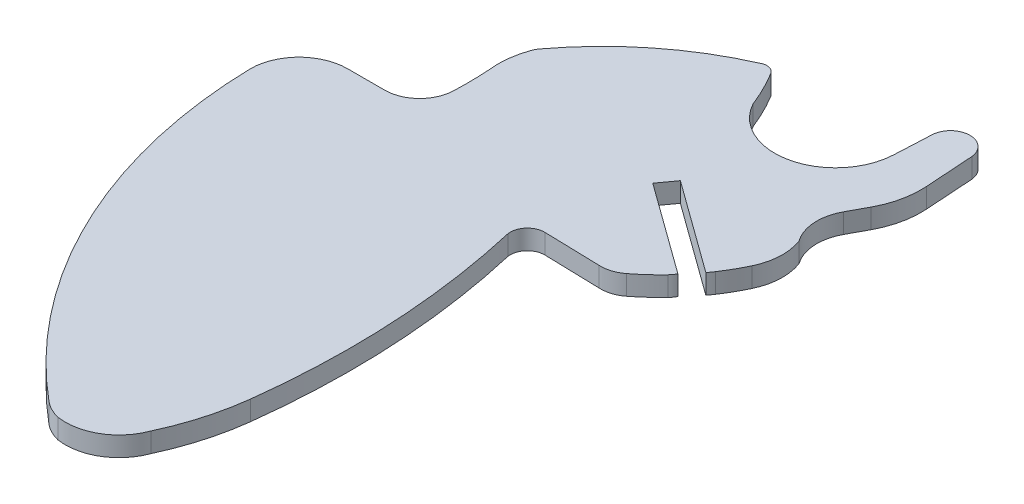
ISO-10303-21;
HEADER;
FILE_DESCRIPTION(('STEP AP214'),'2;1');
FILE_NAME('part.step','',(''),(''),'','','');
FILE_SCHEMA(('AUTOMOTIVE_DESIGN { 1 0 10303 214 1 1 1 1 }'));
ENDSEC;
DATA;
#1=APPLICATION_CONTEXT('core data for automotive mechanical design processes');
#2=APPLICATION_PROTOCOL_DEFINITION('international standard','automotive_design',2000,#1);
#3=PRODUCT_CONTEXT('',#1,'mechanical');
#4=PRODUCT('Part','Part','',(#3));
#5=PRODUCT_RELATED_PRODUCT_CATEGORY('part','',(#4));
#6=PRODUCT_DEFINITION_FORMATION('','',#4);
#7=PRODUCT_DEFINITION_CONTEXT('part definition',#1,'design');
#8=PRODUCT_DEFINITION('design','',#6,#7);
#9=PRODUCT_DEFINITION_SHAPE('','',#8);
#10=(LENGTH_UNIT() NAMED_UNIT(*) SI_UNIT(.MILLI.,.METRE.));
#11=(NAMED_UNIT(*) PLANE_ANGLE_UNIT() SI_UNIT($,.RADIAN.));
#12=(NAMED_UNIT(*) SI_UNIT($,.STERADIAN.) SOLID_ANGLE_UNIT());
#13=UNCERTAINTY_MEASURE_WITH_UNIT(LENGTH_MEASURE(1.E-05),#10,'distance_accuracy_value','');
#14=(GEOMETRIC_REPRESENTATION_CONTEXT(3) GLOBAL_UNCERTAINTY_ASSIGNED_CONTEXT((#13)) GLOBAL_UNIT_ASSIGNED_CONTEXT((#10,
#11,#12)) REPRESENTATION_CONTEXT('',''));
#15=CARTESIAN_POINT('',(0.,0.,0.));
#16=DIRECTION('',(0.,0.,1.));
#17=DIRECTION('',(1.,0.,0.));
#18=AXIS2_PLACEMENT_3D('',#15,#16,#17);
#19=CARTESIAN_POINT('',(239.342860407213,1.45,-286.03723770318));
#20=DIRECTION('',(0.997796574415949,0.,-0.0663475401488044));
#21=DIRECTION('',(-0.0663475401488044,0.,-0.997796574415949));
#22=AXIS2_PLACEMENT_3D('',#19,#20,#21);
#23=PLANE('',#22);
#24=DIRECTION('',(0.0663475401488045,0.,0.997796574415949));
#25=VECTOR('',#24,1.);
#26=CARTESIAN_POINT('',(239.342860407213,0.,-286.03723770318));
#27=LINE('',#26,#25);
#28=CARTESIAN_POINT('',(238.653022555033,0.,-296.411666721409));
#29=VERTEX_POINT('',#28);
#30=CARTESIAN_POINT('',(238.893011470654,0.,-292.802488184158));
#31=VERTEX_POINT('',#30);
#32=EDGE_CURVE('E275',#29,#31,#27,.T.);
#33=ORIENTED_EDGE('',*,*,#32,.F.);
#34=DIRECTION('',(0.,-1.,0.));
#35=VECTOR('',#34,1.);
#36=CARTESIAN_POINT('',(238.653022555033,1.45,-296.411666721409));
#37=LINE('',#36,#35);
#38=CARTESIAN_POINT('',(238.653022555033,1.45,-296.411666721409));
#39=VERTEX_POINT('',#38);
#40=EDGE_CURVE('E11',#39,#29,#37,.T.);
#41=ORIENTED_EDGE('',*,*,#40,.F.);
#42=DIRECTION('',(0.0663475401488045,0.,0.997796574415949));
#43=VECTOR('',#42,1.);
#44=CARTESIAN_POINT('',(239.342860407213,1.45,-286.03723770318));
#45=LINE('',#44,#43);
#46=CARTESIAN_POINT('',(238.893011470654,1.45,-292.802488184158));
#47=VERTEX_POINT('',#46);
#48=EDGE_CURVE('E350',#39,#47,#45,.T.);
#49=ORIENTED_EDGE('',*,*,#48,.T.);
#50=DIRECTION('',(0.,-1.,0.));
#51=VECTOR('',#50,1.);
#52=CARTESIAN_POINT('',(238.893011470654,1.45,-292.802488184158));
#53=LINE('',#52,#51);
#54=EDGE_CURVE('E159',#47,#31,#53,.T.);
#55=ORIENTED_EDGE('',*,*,#54,.T.);
#56=EDGE_LOOP('',(#33,#41,#49,#55));
#57=FACE_BOUND('',#56,.T.);
#58=ADVANCED_FACE('F37',(#57),#23,.T.);
#59=CARTESIAN_POINT('',(237.22674988179,1.45,-296.250436404309));
#60=DIRECTION('',(0.,-1.,0.));
#61=DIRECTION('',(0.,0.,-1.));
#62=AXIS2_PLACEMENT_3D('',#59,#60,#61);
#63=CYLINDRICAL_SURFACE('',#62,1.43535673391348);
#64=CARTESIAN_POINT('',(237.22674988179,0.,-296.250436404309));
#65=DIRECTION('',(0.,1.,0.));
#66=DIRECTION('',(0.,0.,1.));
#67=AXIS2_PLACEMENT_3D('',#64,#65,#66);
#68=CIRCLE('',#67,1.43535673391348);
#69=CARTESIAN_POINT('',(235.793360273238,0.,-296.325557531073));
#70=VERTEX_POINT('',#69);
#71=EDGE_CURVE('E278',#29,#70,#68,.T.);
#72=ORIENTED_EDGE('',*,*,#71,.T.);
#73=DIRECTION('',(0.,-1.,0.));
#74=VECTOR('',#73,1.);
#75=CARTESIAN_POINT('',(235.793360273238,1.45,-296.325557531073));
#76=LINE('',#75,#74);
#77=CARTESIAN_POINT('',(235.793360273238,1.45,-296.325557531073));
#78=VERTEX_POINT('',#77);
#79=EDGE_CURVE('E45',#78,#70,#76,.T.);
#80=ORIENTED_EDGE('',*,*,#79,.F.);
#81=CARTESIAN_POINT('',(237.22674988179,1.45,-296.250436404309));
#82=DIRECTION('',(0.,1.,0.));
#83=DIRECTION('',(0.,0.,1.));
#84=AXIS2_PLACEMENT_3D('',#81,#82,#83);
#85=CIRCLE('',#84,1.43535673391348);
#86=EDGE_CURVE('E442',#39,#78,#85,.T.);
#87=ORIENTED_EDGE('',*,*,#86,.F.);
#88=ORIENTED_EDGE('',*,*,#40,.T.);
#89=EDGE_LOOP('',(#72,#80,#87,#88));
#90=FACE_BOUND('',#89,.T.);
#91=ADVANCED_FACE('F430',(#90),#63,.T.);
#92=CARTESIAN_POINT('',(-108.378688046165,1.45,-311.623136456129));
#93=DIRECTION('',(0.,-1.,0.));
#94=DIRECTION('',(0.,0.,-1.));
#95=AXIS2_PLACEMENT_3D('',#92,#93,#94);
#96=CYLINDRICAL_SURFACE('',#95,344.5118499636);
#97=CARTESIAN_POINT('',(-108.378688046165,0.,-311.623136456129));
#98=DIRECTION('',(0.,1.,0.));
#99=DIRECTION('',(0.,0.,1.));
#100=AXIS2_PLACEMENT_3D('',#97,#98,#99);
#101=CIRCLE('',#100,344.5118499636);
#102=CARTESIAN_POINT('',(235.66102085318,0.,-293.592787990403));
#103=VERTEX_POINT('',#102);
#104=EDGE_CURVE('E281',#103,#70,#101,.T.);
#105=ORIENTED_EDGE('',*,*,#104,.F.);
#106=DIRECTION('',(0.,-1.,0.));
#107=VECTOR('',#106,1.);
#108=CARTESIAN_POINT('',(235.66102085318,1.45,-293.592787990403));
#109=LINE('',#108,#107);
#110=CARTESIAN_POINT('',(235.66102085318,1.45,-293.592787990403));
#111=VERTEX_POINT('',#110);
#112=EDGE_CURVE('E420',#111,#103,#109,.T.);
#113=ORIENTED_EDGE('',*,*,#112,.F.);
#114=CARTESIAN_POINT('',(-108.378688046165,1.45,-311.623136456129));
#115=DIRECTION('',(0.,1.,0.));
#116=DIRECTION('',(0.,0.,1.));
#117=AXIS2_PLACEMENT_3D('',#114,#115,#116);
#118=CIRCLE('',#117,344.5118499636);
#119=EDGE_CURVE('E427',#111,#78,#118,.T.);
#120=ORIENTED_EDGE('',*,*,#119,.T.);
#121=ORIENTED_EDGE('',*,*,#79,.T.);
#122=EDGE_LOOP('',(#105,#113,#120,#121));
#123=FACE_BOUND('',#122,.T.);
#124=ADVANCED_FACE('F425',(#123),#96,.F.);
#125=CARTESIAN_POINT('',(231.174853341948,1.45,-293.827898067158));
#126=DIRECTION('',(0.,-1.,0.));
#127=DIRECTION('',(0.,0.,-1.));
#128=AXIS2_PLACEMENT_3D('',#125,#126,#127);
#129=CYLINDRICAL_SURFACE('',#128,4.49232408526289);
#130=CARTESIAN_POINT('',(231.174853341948,0.,-293.827898067158));
#131=DIRECTION('',(0.,1.,0.));
#132=DIRECTION('',(0.,0.,1.));
#133=AXIS2_PLACEMENT_3D('',#130,#131,#132);
#134=CIRCLE('',#133,4.49232408526289);
#135=CARTESIAN_POINT('',(227.226828646089,0.,-291.684518332271));
#136=VERTEX_POINT('',#135);
#137=EDGE_CURVE('E284',#136,#103,#134,.T.);
#138=ORIENTED_EDGE('',*,*,#137,.F.);
#139=DIRECTION('',(0.,-1.,0.));
#140=VECTOR('',#139,1.);
#141=CARTESIAN_POINT('',(227.226828646089,1.45,-291.684518332271));
#142=LINE('',#141,#140);
#143=CARTESIAN_POINT('',(227.226828646089,1.45,-291.684518332271));
#144=VERTEX_POINT('',#143);
#145=EDGE_CURVE('E418',#144,#136,#142,.T.);
#146=ORIENTED_EDGE('',*,*,#145,.F.);
#147=CARTESIAN_POINT('',(231.174853341948,1.45,-293.827898067158));
#148=DIRECTION('',(0.,1.,0.));
#149=DIRECTION('',(0.,0.,1.));
#150=AXIS2_PLACEMENT_3D('',#147,#148,#149);
#151=CIRCLE('',#150,4.49232408526289);
#152=EDGE_CURVE('E441',#144,#111,#151,.T.);
#153=ORIENTED_EDGE('',*,*,#152,.T.);
#154=ORIENTED_EDGE('',*,*,#112,.T.);
#155=EDGE_LOOP('',(#138,#146,#153,#154));
#156=FACE_BOUND('',#155,.T.);
#157=ADVANCED_FACE('F437',(#156),#129,.F.);
#158=CARTESIAN_POINT('',(211.453490184729,1.45,-285.48871265457));
#159=DIRECTION('',(0.,-1.,0.));
#160=DIRECTION('',(0.,0.,-1.));
#161=AXIS2_PLACEMENT_3D('',#158,#159,#160);
#162=CYLINDRICAL_SURFACE('',#161,16.94656939361);
#163=CARTESIAN_POINT('',(211.453490184729,0.,-285.48871265457));
#164=DIRECTION('',(0.,1.,0.));
#165=DIRECTION('',(0.,0.,1.));
#166=AXIS2_PLACEMENT_3D('',#163,#164,#165);
#167=CIRCLE('',#166,16.94656939361);
#168=CARTESIAN_POINT('',(225.911305804312,0.,-294.32940163918));
#169=VERTEX_POINT('',#168);
#170=EDGE_CURVE('E287',#136,#169,#167,.T.);
#171=ORIENTED_EDGE('',*,*,#170,.T.);
#172=DIRECTION('',(0.,-1.,0.));
#173=VECTOR('',#172,1.);
#174=CARTESIAN_POINT('',(225.911305804312,1.45,-294.32940163918));
#175=LINE('',#174,#173);
#176=CARTESIAN_POINT('',(225.911305804312,1.45,-294.32940163918));
#177=VERTEX_POINT('',#176);
#178=EDGE_CURVE('E415',#177,#169,#175,.T.);
#179=ORIENTED_EDGE('',*,*,#178,.F.);
#180=CARTESIAN_POINT('',(211.453490184729,1.45,-285.48871265457));
#181=DIRECTION('',(0.,1.,0.));
#182=DIRECTION('',(0.,0.,1.));
#183=AXIS2_PLACEMENT_3D('',#180,#181,#182);
#184=CIRCLE('',#183,16.94656939361);
#185=EDGE_CURVE('E444',#144,#177,#184,.T.);
#186=ORIENTED_EDGE('',*,*,#185,.F.);
#187=ORIENTED_EDGE('',*,*,#145,.T.);
#188=EDGE_LOOP('',(#171,#179,#186,#187));
#189=FACE_BOUND('',#188,.T.);
#190=ADVANCED_FACE('F522',(#189),#162,.T.);
#191=CARTESIAN_POINT('',(225.281208839804,1.45,-293.869228525155));
#192=DIRECTION('',(0.,-1.,0.));
#193=DIRECTION('',(0.,0.,-1.));
#194=AXIS2_PLACEMENT_3D('',#191,#192,#193);
#195=CYLINDRICAL_SURFACE('',#194,0.780244499854758);
#196=CARTESIAN_POINT('',(225.281208839804,0.,-293.869228525155));
#197=DIRECTION('',(0.,1.,0.));
#198=DIRECTION('',(0.,0.,1.));
#199=AXIS2_PLACEMENT_3D('',#196,#197,#198);
#200=CIRCLE('',#199,0.780244499854758);
#201=CARTESIAN_POINT('',(224.908611284519,0.,-294.554759371543));
#202=VERTEX_POINT('',#201);
#203=EDGE_CURVE('E289',#169,#202,#200,.T.);
#204=ORIENTED_EDGE('',*,*,#203,.T.);
#205=DIRECTION('',(0.,-1.,0.));
#206=VECTOR('',#205,1.);
#207=CARTESIAN_POINT('',(224.908611284519,1.45,-294.554759371543));
#208=LINE('',#207,#206);
#209=CARTESIAN_POINT('',(224.908611284519,1.45,-294.554759371543));
#210=VERTEX_POINT('',#209);
#211=EDGE_CURVE('E412',#210,#202,#208,.T.);
#212=ORIENTED_EDGE('',*,*,#211,.F.);
#213=CARTESIAN_POINT('',(225.281208839804,1.45,-293.869228525155));
#214=DIRECTION('',(0.,1.,0.));
#215=DIRECTION('',(0.,0.,1.));
#216=AXIS2_PLACEMENT_3D('',#213,#214,#215);
#217=CIRCLE('',#216,0.780244499854758);
#218=EDGE_CURVE('E450',#177,#210,#217,.T.);
#219=ORIENTED_EDGE('',*,*,#218,.F.);
#220=ORIENTED_EDGE('',*,*,#178,.T.);
#221=EDGE_LOOP('',(#204,#212,#219,#220));
#222=FACE_BOUND('',#221,.T.);
#223=ADVANCED_FACE('F525',(#222),#195,.T.);
#224=CARTESIAN_POINT('',(234.125168481019,1.45,-273.692954713846));
#225=DIRECTION('',(0.,-1.,0.));
#226=DIRECTION('',(0.,0.,-1.));
#227=AXIS2_PLACEMENT_3D('',#224,#225,#226);
#228=CYLINDRICAL_SURFACE('',#227,22.807012520983);
#229=CARTESIAN_POINT('',(234.125168481019,0.,-273.692954713846));
#230=DIRECTION('',(0.,1.,0.));
#231=DIRECTION('',(0.,0.,1.));
#232=AXIS2_PLACEMENT_3D('',#229,#230,#231);
#233=CIRCLE('',#232,22.807012520983);
#234=CARTESIAN_POINT('',(215.845643343035,0.,-287.331824933262));
#235=VERTEX_POINT('',#234);
#236=EDGE_CURVE('E291',#202,#235,#233,.T.);
#237=ORIENTED_EDGE('',*,*,#236,.T.);
#238=DIRECTION('',(0.,-1.,0.));
#239=VECTOR('',#238,1.);
#240=CARTESIAN_POINT('',(215.845643343035,1.45,-287.331824933262));
#241=LINE('',#240,#239);
#242=CARTESIAN_POINT('',(215.845643343035,1.45,-287.331824933262));
#243=VERTEX_POINT('',#242);
#244=EDGE_CURVE('E409',#243,#235,#241,.T.);
#245=ORIENTED_EDGE('',*,*,#244,.F.);
#246=CARTESIAN_POINT('',(234.125168481019,1.45,-273.692954713846));
#247=DIRECTION('',(0.,1.,0.));
#248=DIRECTION('',(0.,0.,1.));
#249=AXIS2_PLACEMENT_3D('',#246,#247,#248);
#250=CIRCLE('',#249,22.807012520983);
#251=EDGE_CURVE('E452',#210,#243,#250,.T.);
#252=ORIENTED_EDGE('',*,*,#251,.F.);
#253=ORIENTED_EDGE('',*,*,#211,.T.);
#254=EDGE_LOOP('',(#237,#245,#252,#253));
#255=FACE_BOUND('',#254,.T.);
#256=ADVANCED_FACE('F529',(#255),#228,.T.);
#257=CARTESIAN_POINT('',(217.143035900167,1.45,-286.363804073982));
#258=DIRECTION('',(0.,-1.,0.));
#259=DIRECTION('',(0.,0.,-1.));
#260=AXIS2_PLACEMENT_3D('',#257,#258,#259);
#261=CYLINDRICAL_SURFACE('',#260,1.61873155010442);
#262=CARTESIAN_POINT('',(217.143035900167,0.,-286.363804073982));
#263=DIRECTION('',(0.,1.,0.));
#264=DIRECTION('',(0.,0.,1.));
#265=AXIS2_PLACEMENT_3D('',#262,#263,#264);
#266=CIRCLE('',#265,1.61873155010442);
#267=CARTESIAN_POINT('',(215.642710770853,0.,-286.971518100192));
#268=VERTEX_POINT('',#267);
#269=EDGE_CURVE('E293',#235,#268,#266,.T.);
#270=ORIENTED_EDGE('',*,*,#269,.T.);
#271=DIRECTION('',(0.,-1.,0.));
#272=VECTOR('',#271,1.);
#273=CARTESIAN_POINT('',(215.642710770853,1.45,-286.971518100192));
#274=LINE('',#273,#272);
#275=CARTESIAN_POINT('',(215.642710770853,1.45,-286.971518100192));
#276=VERTEX_POINT('',#275);
#277=EDGE_CURVE('E406',#276,#268,#274,.T.);
#278=ORIENTED_EDGE('',*,*,#277,.F.);
#279=CARTESIAN_POINT('',(217.143035900167,1.45,-286.363804073982));
#280=DIRECTION('',(0.,1.,0.));
#281=DIRECTION('',(0.,0.,1.));
#282=AXIS2_PLACEMENT_3D('',#279,#280,#281);
#283=CIRCLE('',#282,1.61873155010442);
#284=EDGE_CURVE('E454',#243,#276,#283,.T.);
#285=ORIENTED_EDGE('',*,*,#284,.F.);
#286=ORIENTED_EDGE('',*,*,#244,.T.);
#287=EDGE_LOOP('',(#270,#278,#285,#286));
#288=FACE_BOUND('',#287,.T.);
#289=ADVANCED_FACE('F533',(#288),#261,.T.);
#290=CARTESIAN_POINT('',(221.393094772318,1.45,-284.845875835249));
#291=DIRECTION('',(0.,-1.,0.));
#292=DIRECTION('',(0.,0.,-1.));
#293=AXIS2_PLACEMENT_3D('',#290,#291,#292);
#294=CYLINDRICAL_SURFACE('',#293,6.13068276807879);
#295=CARTESIAN_POINT('',(221.393094772318,0.,-284.845875835249));
#296=DIRECTION('',(0.,1.,0.));
#297=DIRECTION('',(0.,0.,1.));
#298=AXIS2_PLACEMENT_3D('',#295,#296,#297);
#299=CIRCLE('',#298,6.13068276807879);
#300=CARTESIAN_POINT('',(215.312427533884,0.,-284.064366309868));
#301=VERTEX_POINT('',#300);
#302=EDGE_CURVE('E295',#268,#301,#299,.T.);
#303=ORIENTED_EDGE('',*,*,#302,.T.);
#304=DIRECTION('',(0.,-1.,0.));
#305=VECTOR('',#304,1.);
#306=CARTESIAN_POINT('',(215.312427533884,1.45,-284.064366309868));
#307=LINE('',#306,#305);
#308=CARTESIAN_POINT('',(215.312427533884,1.45,-284.064366309868));
#309=VERTEX_POINT('',#308);
#310=EDGE_CURVE('E404',#309,#301,#307,.T.);
#311=ORIENTED_EDGE('',*,*,#310,.F.);
#312=CARTESIAN_POINT('',(221.393094772318,1.45,-284.845875835249));
#313=DIRECTION('',(0.,1.,0.));
#314=DIRECTION('',(0.,0.,1.));
#315=AXIS2_PLACEMENT_3D('',#312,#313,#314);
#316=CIRCLE('',#315,6.13068276807879);
#317=EDGE_CURVE('E456',#276,#309,#316,.T.);
#318=ORIENTED_EDGE('',*,*,#317,.F.);
#319=ORIENTED_EDGE('',*,*,#277,.T.);
#320=EDGE_LOOP('',(#303,#311,#318,#319));
#321=FACE_BOUND('',#320,.T.);
#322=ADVANCED_FACE('F537',(#321),#294,.T.);
#323=CARTESIAN_POINT('',(190.902069896325,1.45,-282.490384144395));
#324=DIRECTION('',(0.,-1.,0.));
#325=DIRECTION('',(0.,0.,-1.));
#326=AXIS2_PLACEMENT_3D('',#323,#324,#325);
#327=CYLINDRICAL_SURFACE('',#326,24.4610502605835);
#328=CARTESIAN_POINT('',(190.902069896325,0.,-282.490384144395));
#329=DIRECTION('',(0.,1.,0.));
#330=DIRECTION('',(0.,0.,1.));
#331=AXIS2_PLACEMENT_3D('',#328,#329,#330);
#332=CIRCLE('',#331,24.4610502605835);
#333=CARTESIAN_POINT('',(215.341184768393,0.,-281.454698805769));
#334=VERTEX_POINT('',#333);
#335=EDGE_CURVE('E298',#334,#301,#332,.T.);
#336=ORIENTED_EDGE('',*,*,#335,.F.);
#337=DIRECTION('',(0.,-1.,0.));
#338=VECTOR('',#337,1.);
#339=CARTESIAN_POINT('',(215.341184768393,1.45,-281.454698805769));
#340=LINE('',#339,#338);
#341=CARTESIAN_POINT('',(215.341184768393,1.45,-281.454698805769));
#342=VERTEX_POINT('',#341);
#343=EDGE_CURVE('E402',#342,#334,#340,.T.);
#344=ORIENTED_EDGE('',*,*,#343,.F.);
#345=CARTESIAN_POINT('',(190.902069896325,1.45,-282.490384144395));
#346=DIRECTION('',(0.,1.,0.));
#347=DIRECTION('',(0.,0.,1.));
#348=AXIS2_PLACEMENT_3D('',#345,#346,#347);
#349=CIRCLE('',#348,24.4610502605835);
#350=EDGE_CURVE('E458',#342,#309,#349,.T.);
#351=ORIENTED_EDGE('',*,*,#350,.T.);
#352=ORIENTED_EDGE('',*,*,#310,.T.);
#353=EDGE_LOOP('',(#336,#344,#351,#352));
#354=FACE_BOUND('',#353,.T.);
#355=ADVANCED_FACE('F541',(#354),#327,.F.);
#356=CARTESIAN_POINT('',(212.76590353859,1.45,-281.563834497764));
#357=DIRECTION('',(0.,-1.,0.));
#358=DIRECTION('',(0.,0.,-1.));
#359=AXIS2_PLACEMENT_3D('',#356,#357,#358);
#360=CYLINDRICAL_SURFACE('',#359,2.57759267764408);
#361=CARTESIAN_POINT('',(212.76590353859,0.,-281.563834497764));
#362=DIRECTION('',(0.,1.,0.));
#363=DIRECTION('',(0.,0.,1.));
#364=AXIS2_PLACEMENT_3D('',#361,#362,#363);
#365=CIRCLE('',#364,2.57759267764408);
#366=CARTESIAN_POINT('',(212.76590353859,0.,-278.98624182012));
#367=VERTEX_POINT('',#366);
#368=EDGE_CURVE('E301',#367,#334,#365,.T.);
#369=ORIENTED_EDGE('',*,*,#368,.F.);
#370=DIRECTION('',(0.,-1.,0.));
#371=VECTOR('',#370,1.);
#372=CARTESIAN_POINT('',(212.76590353859,1.45,-278.98624182012));
#373=LINE('',#372,#371);
#374=CARTESIAN_POINT('',(212.76590353859,1.45,-278.98624182012));
#375=VERTEX_POINT('',#374);
#376=EDGE_CURVE('E400',#375,#367,#373,.T.);
#377=ORIENTED_EDGE('',*,*,#376,.F.);
#378=CARTESIAN_POINT('',(212.76590353859,1.45,-281.563834497764));
#379=DIRECTION('',(0.,1.,0.));
#380=DIRECTION('',(0.,0.,1.));
#381=AXIS2_PLACEMENT_3D('',#378,#379,#380);
#382=CIRCLE('',#381,2.57759267764408);
#383=EDGE_CURVE('E461',#375,#342,#382,.T.);
#384=ORIENTED_EDGE('',*,*,#383,.T.);
#385=ORIENTED_EDGE('',*,*,#343,.T.);
#386=EDGE_LOOP('',(#369,#377,#384,#385));
#387=FACE_BOUND('',#386,.T.);
#388=ADVANCED_FACE('F545',(#387),#360,.F.);
#389=CARTESIAN_POINT('',(-48.3605605496074,1.45,-278.986218569562));
#390=DIRECTION('',(-8.90394555433146E-08,0.,-0.999999999999996));
#391=DIRECTION('',(-0.999999999999996,0.,8.90394555433146E-08));
#392=AXIS2_PLACEMENT_3D('',#389,#390,#391);
#393=PLANE('',#392);
#394=DIRECTION('',(0.999999999999996,0.,-8.90394555433147E-08));
#395=VECTOR('',#394,1.);
#396=CARTESIAN_POINT('',(-48.3605605496074,0.,-278.986218569562));
#397=LINE('',#396,#395);
#398=CARTESIAN_POINT('',(210.03682424265,0.,-278.986241577124));
#399=VERTEX_POINT('',#398);
#400=EDGE_CURVE('E304',#399,#367,#397,.T.);
#401=ORIENTED_EDGE('',*,*,#400,.F.);
#402=DIRECTION('',(0.,-1.,0.));
#403=VECTOR('',#402,1.);
#404=CARTESIAN_POINT('',(210.03682424265,1.45,-278.986241577124));
#405=LINE('',#404,#403);
#406=CARTESIAN_POINT('',(210.03682424265,1.45,-278.986241577124));
#407=VERTEX_POINT('',#406);
#408=EDGE_CURVE('E398',#407,#399,#405,.T.);
#409=ORIENTED_EDGE('',*,*,#408,.F.);
#410=DIRECTION('',(0.999999999999996,0.,-8.90394555433147E-08));
#411=VECTOR('',#410,1.);
#412=CARTESIAN_POINT('',(-48.3605605496074,1.45,-278.986218569562));
#413=LINE('',#412,#411);
#414=EDGE_CURVE('E464',#407,#375,#413,.T.);
#415=ORIENTED_EDGE('',*,*,#414,.T.);
#416=ORIENTED_EDGE('',*,*,#376,.T.);
#417=EDGE_LOOP('',(#401,#409,#415,#416));
#418=FACE_BOUND('',#417,.T.);
#419=ADVANCED_FACE('F549',(#418),#393,.T.);
#420=CARTESIAN_POINT('',(210.03682424265,1.45,-275.39026169406));
#421=DIRECTION('',(0.,-1.,0.));
#422=DIRECTION('',(0.,0.,-1.));
#423=AXIS2_PLACEMENT_3D('',#420,#421,#422);
#424=CYLINDRICAL_SURFACE('',#423,3.59597988306427);
#425=CARTESIAN_POINT('',(210.03682424265,0.,-275.39026169406));
#426=DIRECTION('',(0.,1.,0.));
#427=DIRECTION('',(0.,0.,1.));
#428=AXIS2_PLACEMENT_3D('',#425,#426,#427);
#429=CIRCLE('',#428,3.59597988306427);
#430=CARTESIAN_POINT('',(206.440844359586,0.,-275.390261694059));
#431=VERTEX_POINT('',#430);
#432=EDGE_CURVE('E307',#399,#431,#429,.T.);
#433=ORIENTED_EDGE('',*,*,#432,.T.);
#434=DIRECTION('',(0.,-1.,0.));
#435=VECTOR('',#434,1.);
#436=CARTESIAN_POINT('',(206.440844359586,1.45,-275.390261694059));
#437=LINE('',#436,#435);
#438=CARTESIAN_POINT('',(206.440844359586,1.45,-275.390261694059));
#439=VERTEX_POINT('',#438);
#440=EDGE_CURVE('E395',#439,#431,#437,.T.);
#441=ORIENTED_EDGE('',*,*,#440,.F.);
#442=CARTESIAN_POINT('',(210.03682424265,1.45,-275.39026169406));
#443=DIRECTION('',(0.,1.,0.));
#444=DIRECTION('',(0.,0.,1.));
#445=AXIS2_PLACEMENT_3D('',#442,#443,#444);
#446=CIRCLE('',#445,3.59597988306427);
#447=EDGE_CURVE('E467',#407,#439,#446,.T.);
#448=ORIENTED_EDGE('',*,*,#447,.F.);
#449=ORIENTED_EDGE('',*,*,#408,.T.);
#450=EDGE_LOOP('',(#433,#441,#448,#449));
#451=FACE_BOUND('',#450,.T.);
#452=ADVANCED_FACE('F553',(#451),#424,.T.);
#453=CARTESIAN_POINT('',(244.925267792631,1.45,-276.279899589043));
#454=DIRECTION('',(0.,-1.,0.));
#455=DIRECTION('',(0.,0.,-1.));
#456=AXIS2_PLACEMENT_3D('',#453,#454,#455);
#457=CYLINDRICAL_SURFACE('',#456,38.494704863892);
#458=CARTESIAN_POINT('',(244.925267792631,0.,-276.279899589043));
#459=DIRECTION('',(0.,1.,0.));
#460=DIRECTION('',(0.,0.,1.));
#461=AXIS2_PLACEMENT_3D('',#458,#459,#460);
#462=CIRCLE('',#461,38.494704863892);
#463=CARTESIAN_POINT('',(220.27794118263,0.,-246.710462774351));
#464=VERTEX_POINT('',#463);
#465=EDGE_CURVE('E309',#431,#464,#462,.T.);
#466=ORIENTED_EDGE('',*,*,#465,.T.);
#467=DIRECTION('',(0.,-1.,0.));
#468=VECTOR('',#467,1.);
#469=CARTESIAN_POINT('',(220.27794118263,1.45,-246.710462774351));
#470=LINE('',#469,#468);
#471=CARTESIAN_POINT('',(220.27794118263,1.45,-246.710462774351));
#472=VERTEX_POINT('',#471);
#473=EDGE_CURVE('E392',#472,#464,#470,.T.);
#474=ORIENTED_EDGE('',*,*,#473,.F.);
#475=CARTESIAN_POINT('',(244.925267792631,1.45,-276.279899589043));
#476=DIRECTION('',(0.,1.,0.));
#477=DIRECTION('',(0.,0.,1.));
#478=AXIS2_PLACEMENT_3D('',#475,#476,#477);
#479=CIRCLE('',#478,38.494704863892);
#480=EDGE_CURVE('E469',#439,#472,#479,.T.);
#481=ORIENTED_EDGE('',*,*,#480,.F.);
#482=ORIENTED_EDGE('',*,*,#440,.T.);
#483=EDGE_LOOP('',(#466,#474,#481,#482));
#484=FACE_BOUND('',#483,.T.);
#485=ADVANCED_FACE('F557',(#484),#457,.T.);
#486=CARTESIAN_POINT('',(222.373935410536,1.45,-249.22500435528));
#487=DIRECTION('',(0.,-1.,0.));
#488=DIRECTION('',(0.,0.,-1.));
#489=AXIS2_PLACEMENT_3D('',#486,#487,#488);
#490=CYLINDRICAL_SURFACE('',#489,3.27354718396341);
#491=CARTESIAN_POINT('',(222.373935410536,0.,-249.22500435528));
#492=DIRECTION('',(0.,1.,0.));
#493=DIRECTION('',(0.,0.,1.));
#494=AXIS2_PLACEMENT_3D('',#491,#492,#493);
#495=CIRCLE('',#494,3.27354718396341);
#496=CARTESIAN_POINT('',(221.589592945179,0.,-246.046810204087));
#497=VERTEX_POINT('',#496);
#498=EDGE_CURVE('E311',#464,#497,#495,.T.);
#499=ORIENTED_EDGE('',*,*,#498,.T.);
#500=DIRECTION('',(0.,-1.,0.));
#501=VECTOR('',#500,1.);
#502=CARTESIAN_POINT('',(221.589592945179,1.45,-246.046810204087));
#503=LINE('',#502,#501);
#504=CARTESIAN_POINT('',(221.589592945179,1.45,-246.046810204087));
#505=VERTEX_POINT('',#504);
#506=EDGE_CURVE('E389',#505,#497,#503,.T.);
#507=ORIENTED_EDGE('',*,*,#506,.F.);
#508=CARTESIAN_POINT('',(222.373935410536,1.45,-249.22500435528));
#509=DIRECTION('',(0.,1.,0.));
#510=DIRECTION('',(0.,0.,1.));
#511=AXIS2_PLACEMENT_3D('',#508,#509,#510);
#512=CIRCLE('',#511,3.27354718396341);
#513=EDGE_CURVE('E471',#472,#505,#512,.T.);
#514=ORIENTED_EDGE('',*,*,#513,.F.);
#515=ORIENTED_EDGE('',*,*,#473,.T.);
#516=EDGE_LOOP('',(#499,#507,#514,#515));
#517=FACE_BOUND('',#516,.T.);
#518=ADVANCED_FACE('F561',(#517),#490,.T.);
#519=CARTESIAN_POINT('',(222.190871634359,1.45,-249.961498492968));
#520=DIRECTION('',(0.,-1.,0.));
#521=DIRECTION('',(0.,0.,-1.));
#522=AXIS2_PLACEMENT_3D('',#519,#520,#521);
#523=CYLINDRICAL_SURFACE('',#522,3.96059597297722);
#524=CARTESIAN_POINT('',(222.190871634359,0.,-249.961498492968));
#525=DIRECTION('',(0.,1.,0.));
#526=DIRECTION('',(0.,0.,1.));
#527=AXIS2_PLACEMENT_3D('',#524,#525,#526);
#528=CIRCLE('',#527,3.96059597297722);
#529=CARTESIAN_POINT('',(225.905960816543,0.,-248.588752038016));
#530=VERTEX_POINT('',#529);
#531=EDGE_CURVE('E313',#497,#530,#528,.T.);
#532=ORIENTED_EDGE('',*,*,#531,.T.);
#533=DIRECTION('',(0.,-1.,0.));
#534=VECTOR('',#533,1.);
#535=CARTESIAN_POINT('',(225.905960816543,1.45,-248.588752038016));
#536=LINE('',#535,#534);
#537=CARTESIAN_POINT('',(225.905960816543,1.45,-248.588752038016));
#538=VERTEX_POINT('',#537);
#539=EDGE_CURVE('E386',#538,#530,#536,.T.);
#540=ORIENTED_EDGE('',*,*,#539,.F.);
#541=CARTESIAN_POINT('',(222.190871634359,1.45,-249.961498492968));
#542=DIRECTION('',(0.,1.,0.));
#543=DIRECTION('',(0.,0.,1.));
#544=AXIS2_PLACEMENT_3D('',#541,#542,#543);
#545=CIRCLE('',#544,3.96059597297722);
#546=EDGE_CURVE('E473',#505,#538,#545,.T.);
#547=ORIENTED_EDGE('',*,*,#546,.F.);
#548=ORIENTED_EDGE('',*,*,#506,.T.);
#549=EDGE_LOOP('',(#532,#540,#547,#548));
#550=FACE_BOUND('',#549,.T.);
#551=ADVANCED_FACE('F565',(#550),#523,.T.);
#552=CARTESIAN_POINT('',(208.71358547496,1.45,-256.602388158567));
#553=DIRECTION('',(0.,-1.,0.));
#554=DIRECTION('',(0.,0.,-1.));
#555=AXIS2_PLACEMENT_3D('',#552,#553,#554);
#556=CYLINDRICAL_SURFACE('',#555,18.968292853034);
#557=CARTESIAN_POINT('',(208.71358547496,0.,-256.602388158567));
#558=DIRECTION('',(0.,1.,0.));
#559=DIRECTION('',(0.,0.,1.));
#560=AXIS2_PLACEMENT_3D('',#557,#558,#559);
#561=CIRCLE('',#560,18.968292853034);
#562=CARTESIAN_POINT('',(227.542844257863,0.,-254.309977321712));
#563=VERTEX_POINT('',#562);
#564=EDGE_CURVE('E315',#530,#563,#561,.T.);
#565=ORIENTED_EDGE('',*,*,#564,.T.);
#566=DIRECTION('',(0.,-1.,0.));
#567=VECTOR('',#566,1.);
#568=CARTESIAN_POINT('',(227.542844257863,1.45,-254.309977321712));
#569=LINE('',#568,#567);
#570=CARTESIAN_POINT('',(227.542844257863,1.45,-254.309977321712));
#571=VERTEX_POINT('',#570);
#572=EDGE_CURVE('E383',#571,#563,#569,.T.);
#573=ORIENTED_EDGE('',*,*,#572,.F.);
#574=CARTESIAN_POINT('',(208.71358547496,1.45,-256.602388158567));
#575=DIRECTION('',(0.,1.,0.));
#576=DIRECTION('',(0.,0.,1.));
#577=AXIS2_PLACEMENT_3D('',#574,#575,#576);
#578=CIRCLE('',#577,18.968292853034);
#579=EDGE_CURVE('E475',#538,#571,#578,.T.);
#580=ORIENTED_EDGE('',*,*,#579,.F.);
#581=ORIENTED_EDGE('',*,*,#539,.T.);
#582=EDGE_LOOP('',(#565,#573,#580,#581));
#583=FACE_BOUND('',#582,.T.);
#584=ADVANCED_FACE('F569',(#583),#556,.T.);
#585=CARTESIAN_POINT('',(170.111911583872,1.45,-261.302035503144));
#586=DIRECTION('',(0.,-1.,0.));
#587=DIRECTION('',(0.,0.,-1.));
#588=AXIS2_PLACEMENT_3D('',#585,#586,#587);
#589=CYLINDRICAL_SURFACE('',#588,57.854998966528);
#590=CARTESIAN_POINT('',(170.111911583872,0.,-261.302035503144));
#591=DIRECTION('',(0.,1.,0.));
#592=DIRECTION('',(0.,0.,1.));
#593=AXIS2_PLACEMENT_3D('',#590,#591,#592);
#594=CIRCLE('',#593,57.854998966528);
#595=CARTESIAN_POINT('',(226.470760006698,0.,-274.374185665604));
#596=VERTEX_POINT('',#595);
#597=EDGE_CURVE('E317',#563,#596,#594,.T.);
#598=ORIENTED_EDGE('',*,*,#597,.T.);
#599=DIRECTION('',(0.,-1.,0.));
#600=VECTOR('',#599,1.);
#601=CARTESIAN_POINT('',(226.470760006698,1.45,-274.374185665604));
#602=LINE('',#601,#600);
#603=CARTESIAN_POINT('',(226.470760006698,1.45,-274.374185665604));
#604=VERTEX_POINT('',#603);
#605=EDGE_CURVE('E381',#604,#596,#602,.T.);
#606=ORIENTED_EDGE('',*,*,#605,.F.);
#607=CARTESIAN_POINT('',(170.111911583872,1.45,-261.302035503144));
#608=DIRECTION('',(0.,1.,0.));
#609=DIRECTION('',(0.,0.,1.));
#610=AXIS2_PLACEMENT_3D('',#607,#608,#609);
#611=CIRCLE('',#610,57.854998966528);
#612=EDGE_CURVE('E477',#571,#604,#611,.T.);
#613=ORIENTED_EDGE('',*,*,#612,.F.);
#614=ORIENTED_EDGE('',*,*,#572,.T.);
#615=EDGE_LOOP('',(#598,#606,#613,#614));
#616=FACE_BOUND('',#615,.T.);
#617=ADVANCED_FACE('F573',(#616),#589,.T.);
#618=CARTESIAN_POINT('',(227.732274280214,1.45,-274.539833097751));
#619=DIRECTION('',(0.,-1.,0.));
#620=DIRECTION('',(0.,0.,-1.));
#621=AXIS2_PLACEMENT_3D('',#618,#619,#620);
#622=CYLINDRICAL_SURFACE('',#621,1.27234324537926);
#623=CARTESIAN_POINT('',(227.732274280214,0.,-274.539833097751));
#624=DIRECTION('',(0.,1.,0.));
#625=DIRECTION('',(0.,0.,1.));
#626=AXIS2_PLACEMENT_3D('',#623,#624,#625);
#627=CIRCLE('',#626,1.27234324537926);
#628=CARTESIAN_POINT('',(227.766545332812,0.,-275.811714707421));
#629=VERTEX_POINT('',#628);
#630=EDGE_CURVE('E320',#629,#596,#627,.T.);
#631=ORIENTED_EDGE('',*,*,#630,.F.);
#632=DIRECTION('',(0.,-1.,0.));
#633=VECTOR('',#632,1.);
#634=CARTESIAN_POINT('',(227.766545332812,1.45,-275.811714707421));
#635=LINE('',#634,#633);
#636=CARTESIAN_POINT('',(227.766545332812,1.45,-275.811714707421));
#637=VERTEX_POINT('',#636);
#638=EDGE_CURVE('E379',#637,#629,#635,.T.);
#639=ORIENTED_EDGE('',*,*,#638,.F.);
#640=CARTESIAN_POINT('',(227.732274280214,1.45,-274.539833097751));
#641=DIRECTION('',(0.,1.,0.));
#642=DIRECTION('',(0.,0.,1.));
#643=AXIS2_PLACEMENT_3D('',#640,#641,#642);
#644=CIRCLE('',#643,1.27234324537926);
#645=EDGE_CURVE('E479',#637,#604,#644,.T.);
#646=ORIENTED_EDGE('',*,*,#645,.T.);
#647=ORIENTED_EDGE('',*,*,#605,.T.);
#648=EDGE_LOOP('',(#631,#639,#646,#647));
#649=FACE_BOUND('',#648,.T.);
#650=ADVANCED_FACE('F577',(#649),#622,.F.);
#651=CARTESIAN_POINT('',(-47.9204518986769,1.45,-283.240139141716));
#652=DIRECTION('',(0.0269353625954859,0.,-0.999637177300769));
#653=DIRECTION('',(-0.999637177300769,0.,-0.0269353625954859));
#654=AXIS2_PLACEMENT_3D('',#651,#652,#653);
#655=PLANE('',#654);
#656=DIRECTION('',(0.999637177300769,0.,0.0269353625954859));
#657=VECTOR('',#656,1.);
#658=CARTESIAN_POINT('',(-47.9204518986769,0.,-283.240139141716));
#659=LINE('',#658,#657);
#660=CARTESIAN_POINT('',(231.852265795572,0.,-275.701624402031));
#661=VERTEX_POINT('',#660);
#662=EDGE_CURVE('E323',#629,#661,#659,.T.);
#663=ORIENTED_EDGE('',*,*,#662,.T.);
#664=DIRECTION('',(0.,-1.,0.));
#665=VECTOR('',#664,1.);
#666=CARTESIAN_POINT('',(231.852265795572,1.45,-275.701624402031));
#667=LINE('',#666,#665);
#668=CARTESIAN_POINT('',(231.852265795572,1.45,-275.701624402031));
#669=VERTEX_POINT('',#668);
#670=EDGE_CURVE('E376',#669,#661,#667,.T.);
#671=ORIENTED_EDGE('',*,*,#670,.F.);
#672=DIRECTION('',(0.999637177300769,0.,0.0269353625954859));
#673=VECTOR('',#672,1.);
#674=CARTESIAN_POINT('',(-47.9204518986769,1.45,-283.240139141716));
#675=LINE('',#674,#673);
#676=EDGE_CURVE('E482',#637,#669,#675,.T.);
#677=ORIENTED_EDGE('',*,*,#676,.F.);
#678=ORIENTED_EDGE('',*,*,#638,.T.);
#679=EDGE_LOOP('',(#663,#671,#677,#678));
#680=FACE_BOUND('',#679,.T.);
#681=ADVANCED_FACE('F581',(#680),#655,.F.);
#682=CARTESIAN_POINT('',(231.96883773448,1.45,-278.025255123394));
#683=DIRECTION('',(0.,-1.,0.));
#684=DIRECTION('',(0.,0.,-1.));
#685=AXIS2_PLACEMENT_3D('',#682,#683,#684);
#686=CYLINDRICAL_SURFACE('',#685,2.32655297515533);
#687=CARTESIAN_POINT('',(231.96883773448,0.,-278.025255123394));
#688=DIRECTION('',(0.,1.,0.));
#689=DIRECTION('',(0.,0.,1.));
#690=AXIS2_PLACEMENT_3D('',#687,#688,#689);
#691=CIRCLE('',#690,2.32655297515533);
#692=CARTESIAN_POINT('',(233.396048176315,0.,-276.187887685748));
#693=VERTEX_POINT('',#692);
#694=EDGE_CURVE('E325',#661,#693,#691,.T.);
#695=ORIENTED_EDGE('',*,*,#694,.T.);
#696=DIRECTION('',(0.,-1.,0.));
#697=VECTOR('',#696,1.);
#698=CARTESIAN_POINT('',(233.396048176315,1.45,-276.187887685748));
#699=LINE('',#698,#697);
#700=CARTESIAN_POINT('',(233.396048176315,1.45,-276.187887685748));
#701=VERTEX_POINT('',#700);
#702=EDGE_CURVE('E373',#701,#693,#699,.T.);
#703=ORIENTED_EDGE('',*,*,#702,.F.);
#704=CARTESIAN_POINT('',(231.96883773448,1.45,-278.025255123394));
#705=DIRECTION('',(0.,1.,0.));
#706=DIRECTION('',(0.,0.,1.));
#707=AXIS2_PLACEMENT_3D('',#704,#705,#706);
#708=CIRCLE('',#707,2.32655297515533);
#709=EDGE_CURVE('E484',#669,#701,#708,.T.);
#710=ORIENTED_EDGE('',*,*,#709,.F.);
#711=ORIENTED_EDGE('',*,*,#670,.T.);
#712=EDGE_LOOP('',(#695,#703,#710,#711));
#713=FACE_BOUND('',#712,.T.);
#714=ADVANCED_FACE('F585',(#713),#686,.T.);
#715=CARTESIAN_POINT('',(224.610817116699,1.45,-287.497850774416));
#716=DIRECTION('',(0.,-1.,0.));
#717=DIRECTION('',(0.,0.,-1.));
#718=AXIS2_PLACEMENT_3D('',#715,#716,#717);
#719=CYLINDRICAL_SURFACE('',#718,14.321157419632);
#720=CARTESIAN_POINT('',(224.610817116699,0.,-287.497850774416));
#721=DIRECTION('',(0.,1.,0.));
#722=DIRECTION('',(0.,0.,1.));
#723=AXIS2_PLACEMENT_3D('',#720,#721,#722);
#724=CIRCLE('',#723,14.321157419632);
#725=CARTESIAN_POINT('',(235.005599552553,0.,-277.646757030616));
#726=VERTEX_POINT('',#725);
#727=EDGE_CURVE('E327',#693,#726,#724,.T.);
#728=ORIENTED_EDGE('',*,*,#727,.T.);
#729=DIRECTION('',(0.,-1.,0.));
#730=VECTOR('',#729,1.);
#731=CARTESIAN_POINT('',(235.005599552553,1.45,-277.646757030616));
#732=LINE('',#731,#730);
#733=CARTESIAN_POINT('',(235.005599552553,1.45,-277.646757030616));
#734=VERTEX_POINT('',#733);
#735=EDGE_CURVE('E370',#734,#726,#732,.T.);
#736=ORIENTED_EDGE('',*,*,#735,.F.);
#737=CARTESIAN_POINT('',(224.610817116699,1.45,-287.497850774416));
#738=DIRECTION('',(0.,1.,0.));
#739=DIRECTION('',(0.,0.,1.));
#740=AXIS2_PLACEMENT_3D('',#737,#738,#739);
#741=CIRCLE('',#740,14.321157419632);
#742=EDGE_CURVE('E486',#701,#734,#741,.T.);
#743=ORIENTED_EDGE('',*,*,#742,.F.);
#744=ORIENTED_EDGE('',*,*,#702,.T.);
#745=EDGE_LOOP('',(#728,#736,#743,#744));
#746=FACE_BOUND('',#745,.T.);
#747=ADVANCED_FACE('F589',(#746),#719,.T.);
#748=CARTESIAN_POINT('',(233.583705069533,1.45,-278.994281000803));
#749=DIRECTION('',(0.,-1.,0.));
#750=DIRECTION('',(0.,0.,-1.));
#751=AXIS2_PLACEMENT_3D('',#748,#749,#750);
#752=CYLINDRICAL_SURFACE('',#751,1.95898054382129);
#753=CARTESIAN_POINT('',(233.583705069533,0.,-278.994281000803));
#754=DIRECTION('',(0.,1.,0.));
#755=DIRECTION('',(0.,0.,1.));
#756=AXIS2_PLACEMENT_3D('',#753,#754,#755);
#757=CIRCLE('',#756,1.95898054382129);
#758=CARTESIAN_POINT('',(235.307720812948,0.,-278.064025934958));
#759=VERTEX_POINT('',#758);
#760=EDGE_CURVE('E329',#726,#759,#757,.T.);
#761=ORIENTED_EDGE('',*,*,#760,.T.);
#762=DIRECTION('',(0.,-1.,0.));
#763=VECTOR('',#762,1.);
#764=CARTESIAN_POINT('',(235.307720812948,1.45,-278.064025934958));
#765=LINE('',#764,#763);
#766=CARTESIAN_POINT('',(235.307720812948,1.45,-278.064025934958));
#767=VERTEX_POINT('',#766);
#768=EDGE_CURVE('E368',#767,#759,#765,.T.);
#769=ORIENTED_EDGE('',*,*,#768,.F.);
#770=CARTESIAN_POINT('',(233.583705069533,1.45,-278.994281000803));
#771=DIRECTION('',(0.,1.,0.));
#772=DIRECTION('',(0.,0.,1.));
#773=AXIS2_PLACEMENT_3D('',#770,#771,#772);
#774=CIRCLE('',#773,1.95898054382129);
#775=EDGE_CURVE('E488',#734,#767,#774,.T.);
#776=ORIENTED_EDGE('',*,*,#775,.F.);
#777=ORIENTED_EDGE('',*,*,#735,.T.);
#778=EDGE_LOOP('',(#761,#769,#776,#777));
#779=FACE_BOUND('',#778,.T.);
#780=ADVANCED_FACE('F593',(#779),#752,.T.);
#781=CARTESIAN_POINT('',(54.5029744361637,1.45,-408.974676862814));
#782=DIRECTION('',(0.586460074531715,0.,-0.809978136112485));
#783=DIRECTION('',(-0.809978136112485,0.,-0.586460074531715));
#784=AXIS2_PLACEMENT_3D('',#781,#782,#783);
#785=PLANE('',#784);
#786=DIRECTION('',(0.809978136112485,0.,0.586460074531715));
#787=VECTOR('',#786,1.);
#788=CARTESIAN_POINT('',(54.5029744361637,0.,-408.974676862814));
#789=LINE('',#788,#787);
#790=CARTESIAN_POINT('',(228.590146914832,0.,-282.927847207801));
#791=VERTEX_POINT('',#790);
#792=EDGE_CURVE('E332',#791,#759,#789,.T.);
#793=ORIENTED_EDGE('',*,*,#792,.F.);
#794=DIRECTION('',(0.,-1.,0.));
#795=VECTOR('',#794,1.);
#796=CARTESIAN_POINT('',(228.590146914832,1.45,-282.927847207801));
#797=LINE('',#796,#795);
#798=CARTESIAN_POINT('',(228.590146914832,1.45,-282.927847207801));
#799=VERTEX_POINT('',#798);
#800=EDGE_CURVE('E366',#799,#791,#797,.T.);
#801=ORIENTED_EDGE('',*,*,#800,.F.);
#802=DIRECTION('',(0.809978136112485,0.,0.586460074531715));
#803=VECTOR('',#802,1.);
#804=CARTESIAN_POINT('',(54.5029744361637,1.45,-408.974676862814));
#805=LINE('',#804,#803);
#806=EDGE_CURVE('E490',#799,#767,#805,.T.);
#807=ORIENTED_EDGE('',*,*,#806,.T.);
#808=ORIENTED_EDGE('',*,*,#768,.T.);
#809=EDGE_LOOP('',(#793,#801,#807,#808));
#810=FACE_BOUND('',#809,.T.);
#811=ADVANCED_FACE('F597',(#810),#785,.T.);
#812=CARTESIAN_POINT('',(125.726605789203,1.45,-140.859839149175));
#813=DIRECTION('',(-0.809978120329873,0.,-0.586460096329568));
#814=DIRECTION('',(-0.586460096329568,0.,0.809978120329873));
#815=AXIS2_PLACEMENT_3D('',#812,#813,#814);
#816=PLANE('',#815);
#817=DIRECTION('',(0.586460096329568,0.,-0.809978120329873));
#818=VECTOR('',#817,1.);
#819=CARTESIAN_POINT('',(125.726605789203,0.,-140.859839149175));
#820=LINE('',#819,#818);
#821=CARTESIAN_POINT('',(229.445051064467,0.,-284.108581686613));
#822=VERTEX_POINT('',#821);
#823=EDGE_CURVE('E335',#791,#822,#820,.T.);
#824=ORIENTED_EDGE('',*,*,#823,.T.);
#825=DIRECTION('',(0.,-1.,0.));
#826=VECTOR('',#825,1.);
#827=CARTESIAN_POINT('',(229.445051064467,1.45,-284.108581686613));
#828=LINE('',#827,#826);
#829=CARTESIAN_POINT('',(229.445051064467,1.45,-284.108581686613));
#830=VERTEX_POINT('',#829);
#831=EDGE_CURVE('E363',#830,#822,#828,.T.);
#832=ORIENTED_EDGE('',*,*,#831,.F.);
#833=DIRECTION('',(0.586460096329568,0.,-0.809978120329873));
#834=VECTOR('',#833,1.);
#835=CARTESIAN_POINT('',(125.726605789203,1.45,-140.859839149175));
#836=LINE('',#835,#834);
#837=EDGE_CURVE('E493',#799,#830,#836,.T.);
#838=ORIENTED_EDGE('',*,*,#837,.F.);
#839=ORIENTED_EDGE('',*,*,#800,.T.);
#840=EDGE_LOOP('',(#824,#832,#838,#839));
#841=FACE_BOUND('',#840,.T.);
#842=ADVANCED_FACE('F601',(#841),#816,.F.);
#843=CARTESIAN_POINT('',(55.3578746809372,1.45,-410.155410352569));
#844=DIRECTION('',(0.586460062882378,0.,-0.809978144547122));
#845=DIRECTION('',(-0.809978144547122,0.,-0.586460062882378));
#846=AXIS2_PLACEMENT_3D('',#843,#844,#845);
#847=PLANE('',#846);
#848=DIRECTION('',(0.809978144547122,0.,0.586460062882378));
#849=VECTOR('',#848,1.);
#850=CARTESIAN_POINT('',(55.3578746809372,0.,-410.155410352569));
#851=LINE('',#850,#849);
#852=CARTESIAN_POINT('',(236.252979759793,0.,-279.179339684667));
#853=VERTEX_POINT('',#852);
#854=EDGE_CURVE('E337',#822,#853,#851,.T.);
#855=ORIENTED_EDGE('',*,*,#854,.T.);
#856=DIRECTION('',(0.,-1.,0.));
#857=VECTOR('',#856,1.);
#858=CARTESIAN_POINT('',(236.252979759793,1.45,-279.179339684667));
#859=LINE('',#858,#857);
#860=CARTESIAN_POINT('',(236.252979759793,1.45,-279.179339684667));
#861=VERTEX_POINT('',#860);
#862=EDGE_CURVE('E360',#861,#853,#859,.T.);
#863=ORIENTED_EDGE('',*,*,#862,.F.);
#864=DIRECTION('',(0.809978144547122,0.,0.586460062882378));
#865=VECTOR('',#864,1.);
#866=CARTESIAN_POINT('',(55.3578746809372,1.45,-410.155410352569));
#867=LINE('',#866,#865);
#868=EDGE_CURVE('E495',#830,#861,#867,.T.);
#869=ORIENTED_EDGE('',*,*,#868,.F.);
#870=ORIENTED_EDGE('',*,*,#831,.T.);
#871=EDGE_LOOP('',(#855,#863,#869,#870));
#872=FACE_BOUND('',#871,.T.);
#873=ADVANCED_FACE('F605',(#872),#847,.F.);
#874=CARTESIAN_POINT('',(231.469897869392,1.45,-282.960511248735));
#875=DIRECTION('',(0.,-1.,0.));
#876=DIRECTION('',(0.,0.,-1.));
#877=AXIS2_PLACEMENT_3D('',#874,#875,#876);
#878=CYLINDRICAL_SURFACE('',#877,6.09714119626642);
#879=CARTESIAN_POINT('',(231.469897869392,0.,-282.960511248735));
#880=DIRECTION('',(0.,1.,0.));
#881=DIRECTION('',(0.,0.,1.));
#882=AXIS2_PLACEMENT_3D('',#879,#880,#881);
#883=CIRCLE('',#882,6.09714119626642);
#884=CARTESIAN_POINT('',(236.555100734749,0.,-279.596608368839));
#885=VERTEX_POINT('',#884);
#886=EDGE_CURVE('E339',#853,#885,#883,.T.);
#887=ORIENTED_EDGE('',*,*,#886,.T.);
#888=DIRECTION('',(0.,-1.,0.));
#889=VECTOR('',#888,1.);
#890=CARTESIAN_POINT('',(236.555100734749,1.45,-279.596608368839));
#891=LINE('',#890,#889);
#892=CARTESIAN_POINT('',(236.555100734749,1.45,-279.596608368839));
#893=VERTEX_POINT('',#892);
#894=EDGE_CURVE('E357',#893,#885,#891,.T.);
#895=ORIENTED_EDGE('',*,*,#894,.F.);
#896=CARTESIAN_POINT('',(231.469897869392,1.45,-282.960511248735));
#897=DIRECTION('',(0.,1.,0.));
#898=DIRECTION('',(0.,0.,1.));
#899=AXIS2_PLACEMENT_3D('',#896,#897,#898);
#900=CIRCLE('',#899,6.09714119626642);
#901=EDGE_CURVE('E497',#861,#893,#900,.T.);
#902=ORIENTED_EDGE('',*,*,#901,.F.);
#903=ORIENTED_EDGE('',*,*,#862,.T.);
#904=EDGE_LOOP('',(#887,#895,#902,#903));
#905=FACE_BOUND('',#904,.T.);
#906=ADVANCED_FACE('F609',(#905),#878,.T.);
#907=CARTESIAN_POINT('',(224.610817116699,1.45,-287.497850774416));
#908=DIRECTION('',(0.,-1.,0.));
#909=DIRECTION('',(0.,0.,-1.));
#910=AXIS2_PLACEMENT_3D('',#907,#908,#909);
#911=CYLINDRICAL_SURFACE('',#910,14.3211571704284);
#912=CARTESIAN_POINT('',(224.610817116699,0.,-287.497850774416));
#913=DIRECTION('',(0.,1.,0.));
#914=DIRECTION('',(0.,0.,1.));
#915=AXIS2_PLACEMENT_3D('',#912,#913,#914);
#916=CIRCLE('',#915,14.3211571704284);
#917=CARTESIAN_POINT('',(237.524234563944,0.,-281.305985745745));
#918=VERTEX_POINT('',#917);
#919=EDGE_CURVE('E341',#885,#918,#916,.T.);
#920=ORIENTED_EDGE('',*,*,#919,.T.);
#921=DIRECTION('',(0.,-1.,0.));
#922=VECTOR('',#921,1.);
#923=CARTESIAN_POINT('',(237.524234563944,1.45,-281.305985745745));
#924=LINE('',#923,#922);
#925=CARTESIAN_POINT('',(237.524234563944,1.45,-281.305985745745));
#926=VERTEX_POINT('',#925);
#927=EDGE_CURVE('E354',#926,#918,#924,.T.);
#928=ORIENTED_EDGE('',*,*,#927,.F.);
#929=CARTESIAN_POINT('',(224.610817116699,1.45,-287.497850774416));
#930=DIRECTION('',(0.,1.,0.));
#931=DIRECTION('',(0.,0.,1.));
#932=AXIS2_PLACEMENT_3D('',#929,#930,#931);
#933=CIRCLE('',#932,14.3211571704284);
#934=EDGE_CURVE('E270',#893,#926,#933,.T.);
#935=ORIENTED_EDGE('',*,*,#934,.F.);
#936=ORIENTED_EDGE('',*,*,#894,.T.);
#937=EDGE_LOOP('',(#920,#928,#935,#936));
#938=FACE_BOUND('',#937,.T.);
#939=ADVANCED_FACE('F503',(#938),#911,.T.);
#940=CARTESIAN_POINT('',(233.691535220052,1.45,-283.143730205093));
#941=DIRECTION('',(0.,-1.,0.));
#942=DIRECTION('',(0.,0.,-1.));
#943=AXIS2_PLACEMENT_3D('',#940,#941,#942);
#944=CYLINDRICAL_SURFACE('',#943,4.25051631670058);
#945=CARTESIAN_POINT('',(233.691535220052,0.,-283.143730205093));
#946=DIRECTION('',(0.,1.,0.));
#947=DIRECTION('',(0.,0.,1.));
#948=AXIS2_PLACEMENT_3D('',#945,#946,#947);
#949=CIRCLE('',#948,4.25051631670058);
#950=CARTESIAN_POINT('',(237.671859747597,0.,-284.635006709958));
#951=VERTEX_POINT('',#950);
#952=EDGE_CURVE('E343',#918,#951,#949,.T.);
#953=ORIENTED_EDGE('',*,*,#952,.T.);
#954=DIRECTION('',(0.,-1.,0.));
#955=VECTOR('',#954,1.);
#956=CARTESIAN_POINT('',(237.671859747597,1.45,-284.635006709958));
#957=LINE('',#956,#955);
#958=CARTESIAN_POINT('',(237.671859747597,1.45,-284.635006709958));
#959=VERTEX_POINT('',#958);
#960=EDGE_CURVE('E259',#959,#951,#957,.T.);
#961=ORIENTED_EDGE('',*,*,#960,.F.);
#962=CARTESIAN_POINT('',(233.691535220052,1.45,-283.143730205093));
#963=DIRECTION('',(0.,1.,0.));
#964=DIRECTION('',(0.,0.,1.));
#965=AXIS2_PLACEMENT_3D('',#962,#963,#964);
#966=CIRCLE('',#965,4.25051631670058);
#967=EDGE_CURVE('E267',#926,#959,#966,.T.);
#968=ORIENTED_EDGE('',*,*,#967,.F.);
#969=ORIENTED_EDGE('',*,*,#927,.T.);
#970=EDGE_LOOP('',(#953,#961,#968,#969));
#971=FACE_BOUND('',#970,.T.);
#972=ADVANCED_FACE('F507',(#971),#944,.T.);
#973=CARTESIAN_POINT('',(240.359520946703,1.45,-286.561939250869));
#974=DIRECTION('',(0.,-1.,0.));
#975=DIRECTION('',(0.,0.,-1.));
#976=AXIS2_PLACEMENT_3D('',#973,#974,#975);
#977=CYLINDRICAL_SURFACE('',#976,3.30705181973302);
#978=CARTESIAN_POINT('',(240.359520946703,0.,-286.561939250869));
#979=DIRECTION('',(0.,1.,0.));
#980=DIRECTION('',(0.,0.,1.));
#981=AXIS2_PLACEMENT_3D('',#978,#979,#980);
#982=CIRCLE('',#981,3.30705181973302);
#983=CARTESIAN_POINT('',(237.45037475703,0.,-288.134663061814));
#984=VERTEX_POINT('',#983);
#985=EDGE_CURVE('E258',#984,#951,#982,.T.);
#986=ORIENTED_EDGE('',*,*,#985,.F.);
#987=DIRECTION('',(0.,-1.,0.));
#988=VECTOR('',#987,1.);
#989=CARTESIAN_POINT('',(237.45037475703,1.45,-288.134663061814));
#990=LINE('',#989,#988);
#991=CARTESIAN_POINT('',(237.45037475703,1.45,-288.134663061814));
#992=VERTEX_POINT('',#991);
#993=EDGE_CURVE('E252',#992,#984,#990,.T.);
#994=ORIENTED_EDGE('',*,*,#993,.F.);
#995=CARTESIAN_POINT('',(240.359520946703,1.45,-286.561939250869));
#996=DIRECTION('',(0.,1.,0.));
#997=DIRECTION('',(0.,0.,1.));
#998=AXIS2_PLACEMENT_3D('',#995,#996,#997);
#999=CIRCLE('',#998,3.30705181973302);
#1000=EDGE_CURVE('E256',#992,#959,#999,.T.);
#1001=ORIENTED_EDGE('',*,*,#1000,.T.);
#1002=ORIENTED_EDGE('',*,*,#960,.T.);
#1003=EDGE_LOOP('',(#986,#994,#1001,#1002));
#1004=FACE_BOUND('',#1003,.T.);
#1005=ADVANCED_FACE('F254',(#1004),#977,.F.);
#1006=CARTESIAN_POINT('',(163.929642703241,1.45,-152.139695501663));
#1007=DIRECTION('',(-0.879679619211447,0.,-0.475566785576961));
#1008=DIRECTION('',(-0.475566785576961,0.,0.879679619211447));
#1009=AXIS2_PLACEMENT_3D('',#1006,#1007,#1008);
#1010=PLANE('',#1009);
#1011=DIRECTION('',(0.475566785576961,0.,-0.879679619211447));
#1012=VECTOR('',#1011,1.);
#1013=CARTESIAN_POINT('',(163.929642703241,0.,-152.139695501663));
#1014=LINE('',#1013,#1012);
#1015=CARTESIAN_POINT('',(238.162856481843,0.,-289.452576068749));
#1016=VERTEX_POINT('',#1015);
#1017=EDGE_CURVE('E152',#984,#1016,#1014,.T.);
#1018=ORIENTED_EDGE('',*,*,#1017,.T.);
#1019=DIRECTION('',(0.,-1.,0.));
#1020=VECTOR('',#1019,1.);
#1021=CARTESIAN_POINT('',(238.162856481843,1.45,-289.452576068749));
#1022=LINE('',#1021,#1020);
#1023=CARTESIAN_POINT('',(238.162856481843,1.45,-289.452576068749));
#1024=VERTEX_POINT('',#1023);
#1025=EDGE_CURVE('E260',#1024,#1016,#1022,.T.);
#1026=ORIENTED_EDGE('',*,*,#1025,.F.);
#1027=DIRECTION('',(0.475566785576961,0.,-0.879679619211447));
#1028=VECTOR('',#1027,1.);
#1029=CARTESIAN_POINT('',(163.929642703241,1.45,-152.139695501663));
#1030=LINE('',#1029,#1028);
#1031=EDGE_CURVE('E262',#992,#1024,#1030,.T.);
#1032=ORIENTED_EDGE('',*,*,#1031,.F.);
#1033=ORIENTED_EDGE('',*,*,#993,.T.);
#1034=EDGE_LOOP('',(#1018,#1026,#1032,#1033));
#1035=FACE_BOUND('',#1034,.T.);
#1036=ADVANCED_FACE('F263',(#1035),#1010,.F.);
#1037=CARTESIAN_POINT('',(232.725005414154,1.45,-292.392352543633));
#1038=DIRECTION('',(0.,-1.,0.));
#1039=DIRECTION('',(0.,0.,-1.));
#1040=AXIS2_PLACEMENT_3D('',#1037,#1038,#1039);
#1041=CYLINDRICAL_SURFACE('',#1040,6.18162680502846);
#1042=CARTESIAN_POINT('',(232.725005414154,0.,-292.392352543633));
#1043=DIRECTION('',(0.,1.,0.));
#1044=DIRECTION('',(0.,0.,1.));
#1045=AXIS2_PLACEMENT_3D('',#1042,#1043,#1044);
#1046=CIRCLE('',#1045,6.18162680502846);
#1047=EDGE_CURVE('E348',#1016,#31,#1046,.T.);
#1048=ORIENTED_EDGE('',*,*,#1047,.T.);
#1049=ORIENTED_EDGE('',*,*,#54,.F.);
#1050=CARTESIAN_POINT('',(232.725005414154,1.45,-292.392352543633));
#1051=DIRECTION('',(0.,1.,0.));
#1052=DIRECTION('',(0.,0.,1.));
#1053=AXIS2_PLACEMENT_3D('',#1050,#1051,#1052);
#1054=CIRCLE('',#1053,6.18162680502846);
#1055=EDGE_CURVE('E53',#1024,#47,#1054,.T.);
#1056=ORIENTED_EDGE('',*,*,#1055,.F.);
#1057=ORIENTED_EDGE('',*,*,#1025,.T.);
#1058=EDGE_LOOP('',(#1048,#1049,#1056,#1057));
#1059=FACE_BOUND('',#1058,.T.);
#1060=ADVANCED_FACE('F510',(#1059),#1041,.T.);
#1061=CARTESIAN_POINT('',(-48.360559474051,1.45,-266.906670720934));
#1062=DIRECTION('',(0.,1.,0.));
#1063=DIRECTION('',(0.,0.,1.));
#1064=AXIS2_PLACEMENT_3D('',#1061,#1062,#1063);
#1065=PLANE('',#1064);
#1066=ORIENTED_EDGE('',*,*,#48,.F.);
#1067=ORIENTED_EDGE('',*,*,#86,.T.);
#1068=ORIENTED_EDGE('',*,*,#119,.F.);
#1069=ORIENTED_EDGE('',*,*,#152,.F.);
#1070=ORIENTED_EDGE('',*,*,#185,.T.);
#1071=ORIENTED_EDGE('',*,*,#218,.T.);
#1072=ORIENTED_EDGE('',*,*,#251,.T.);
#1073=ORIENTED_EDGE('',*,*,#284,.T.);
#1074=ORIENTED_EDGE('',*,*,#317,.T.);
#1075=ORIENTED_EDGE('',*,*,#350,.F.);
#1076=ORIENTED_EDGE('',*,*,#383,.F.);
#1077=ORIENTED_EDGE('',*,*,#414,.F.);
#1078=ORIENTED_EDGE('',*,*,#447,.T.);
#1079=ORIENTED_EDGE('',*,*,#480,.T.);
#1080=ORIENTED_EDGE('',*,*,#513,.T.);
#1081=ORIENTED_EDGE('',*,*,#546,.T.);
#1082=ORIENTED_EDGE('',*,*,#579,.T.);
#1083=ORIENTED_EDGE('',*,*,#612,.T.);
#1084=ORIENTED_EDGE('',*,*,#645,.F.);
#1085=ORIENTED_EDGE('',*,*,#676,.T.);
#1086=ORIENTED_EDGE('',*,*,#709,.T.);
#1087=ORIENTED_EDGE('',*,*,#742,.T.);
#1088=ORIENTED_EDGE('',*,*,#775,.T.);
#1089=ORIENTED_EDGE('',*,*,#806,.F.);
#1090=ORIENTED_EDGE('',*,*,#837,.T.);
#1091=ORIENTED_EDGE('',*,*,#868,.T.);
#1092=ORIENTED_EDGE('',*,*,#901,.T.);
#1093=ORIENTED_EDGE('',*,*,#934,.T.);
#1094=ORIENTED_EDGE('',*,*,#967,.T.);
#1095=ORIENTED_EDGE('',*,*,#1000,.F.);
#1096=ORIENTED_EDGE('',*,*,#1031,.T.);
#1097=ORIENTED_EDGE('',*,*,#1055,.T.);
#1098=EDGE_LOOP('',(#1066,#1067,#1068,#1069,#1070,#1071,#1072,#1073,#1074,#1075,#1076,#1077,
#1078,#1079,#1080,#1081,#1082,#1083,#1084,#1085,#1086,#1087,#1088,#1089,#1090,#1091,#1092,#1093,
#1094,#1095,#1096,#1097));
#1099=FACE_BOUND('',#1098,.T.);
#1100=ADVANCED_FACE('F265',(#1099),#1065,.T.);
#1101=CARTESIAN_POINT('',(-48.360559474051,0.,-266.906670720934));
#1102=DIRECTION('',(0.,1.,0.));
#1103=DIRECTION('',(0.,0.,1.));
#1104=AXIS2_PLACEMENT_3D('',#1101,#1102,#1103);
#1105=PLANE('',#1104);
#1106=ORIENTED_EDGE('',*,*,#32,.T.);
#1107=ORIENTED_EDGE('',*,*,#1047,.F.);
#1108=ORIENTED_EDGE('',*,*,#1017,.F.);
#1109=ORIENTED_EDGE('',*,*,#985,.T.);
#1110=ORIENTED_EDGE('',*,*,#952,.F.);
#1111=ORIENTED_EDGE('',*,*,#919,.F.);
#1112=ORIENTED_EDGE('',*,*,#886,.F.);
#1113=ORIENTED_EDGE('',*,*,#854,.F.);
#1114=ORIENTED_EDGE('',*,*,#823,.F.);
#1115=ORIENTED_EDGE('',*,*,#792,.T.);
#1116=ORIENTED_EDGE('',*,*,#760,.F.);
#1117=ORIENTED_EDGE('',*,*,#727,.F.);
#1118=ORIENTED_EDGE('',*,*,#694,.F.);
#1119=ORIENTED_EDGE('',*,*,#662,.F.);
#1120=ORIENTED_EDGE('',*,*,#630,.T.);
#1121=ORIENTED_EDGE('',*,*,#597,.F.);
#1122=ORIENTED_EDGE('',*,*,#564,.F.);
#1123=ORIENTED_EDGE('',*,*,#531,.F.);
#1124=ORIENTED_EDGE('',*,*,#498,.F.);
#1125=ORIENTED_EDGE('',*,*,#465,.F.);
#1126=ORIENTED_EDGE('',*,*,#432,.F.);
#1127=ORIENTED_EDGE('',*,*,#400,.T.);
#1128=ORIENTED_EDGE('',*,*,#368,.T.);
#1129=ORIENTED_EDGE('',*,*,#335,.T.);
#1130=ORIENTED_EDGE('',*,*,#302,.F.);
#1131=ORIENTED_EDGE('',*,*,#269,.F.);
#1132=ORIENTED_EDGE('',*,*,#236,.F.);
#1133=ORIENTED_EDGE('',*,*,#203,.F.);
#1134=ORIENTED_EDGE('',*,*,#170,.F.);
#1135=ORIENTED_EDGE('',*,*,#137,.T.);
#1136=ORIENTED_EDGE('',*,*,#104,.T.);
#1137=ORIENTED_EDGE('',*,*,#71,.F.);
#1138=EDGE_LOOP('',(#1106,#1107,#1108,#1109,#1110,#1111,#1112,#1113,#1114,#1115,#1116,#1117,
#1118,#1119,#1120,#1121,#1122,#1123,#1124,#1125,#1126,#1127,#1128,#1129,#1130,#1131,#1132,#1133,
#1134,#1135,#1136,#1137));
#1139=FACE_BOUND('',#1138,.T.);
#1140=ADVANCED_FACE('F432',(#1139),#1105,.F.);
#1141=CLOSED_SHELL('',(#58,#91,#124,#157,#190,#223,#256,#289,#322,#355,#388,#419,#452,#485,#518,
#551,#584,#617,#650,#681,#714,#747,#780,#811,#842,#873,#906,#939,#972,#1005,#1036,#1060,#1100,#1140));
#1142=MANIFOLD_SOLID_BREP('B2',#1141);
#1143=ADVANCED_BREP_SHAPE_REPRESENTATION('',(#18,#1142),#14);
#1144=SHAPE_DEFINITION_REPRESENTATION(#9,#1143);
ENDSEC;
END-ISO-10303-21;
